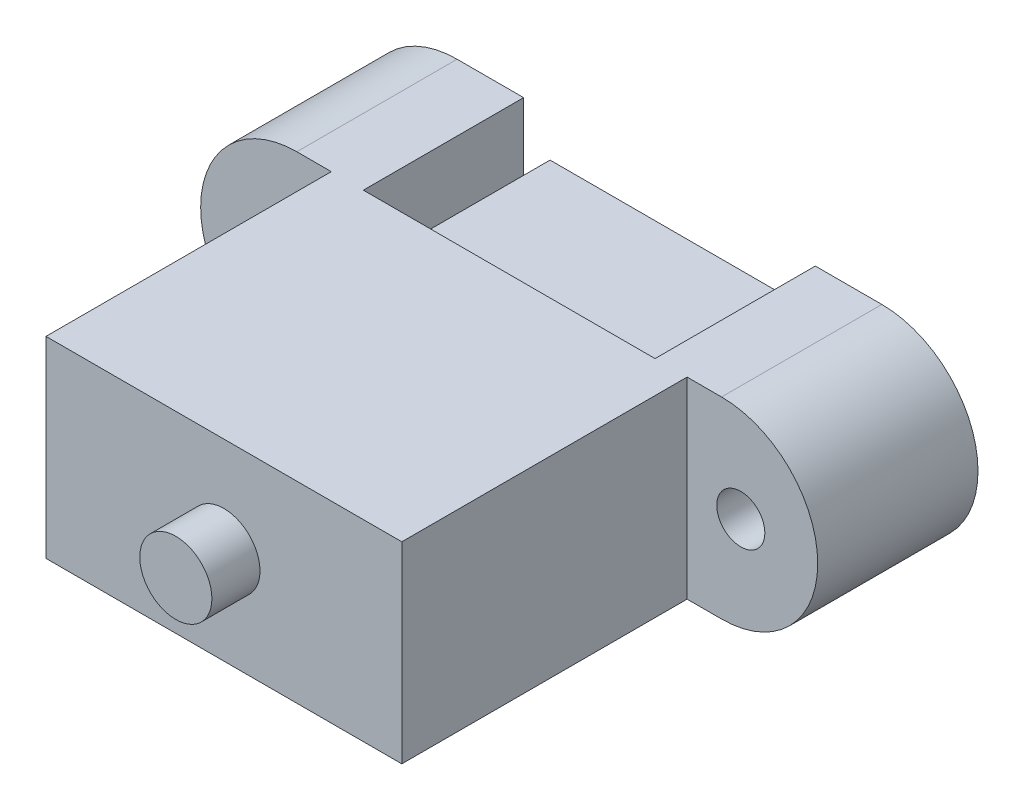
ISO-10303-21;
HEADER;
FILE_DESCRIPTION(('STEP AP214'),'2;1');
FILE_NAME('part.step','',(''),(''),'','','');
FILE_SCHEMA(('AUTOMOTIVE_DESIGN { 1 0 10303 214 1 1 1 1 }'));
ENDSEC;
DATA;
#1=APPLICATION_CONTEXT('core data for automotive mechanical design processes');
#2=APPLICATION_PROTOCOL_DEFINITION('international standard','automotive_design',2000,#1);
#3=PRODUCT_CONTEXT('',#1,'mechanical');
#4=PRODUCT('Part','Part','',(#3));
#5=PRODUCT_RELATED_PRODUCT_CATEGORY('part','',(#4));
#6=PRODUCT_DEFINITION_FORMATION('','',#4);
#7=PRODUCT_DEFINITION_CONTEXT('part definition',#1,'design');
#8=PRODUCT_DEFINITION('design','',#6,#7);
#9=PRODUCT_DEFINITION_SHAPE('','',#8);
#10=(LENGTH_UNIT() NAMED_UNIT(*) SI_UNIT(.MILLI.,.METRE.));
#11=(NAMED_UNIT(*) PLANE_ANGLE_UNIT() SI_UNIT($,.RADIAN.));
#12=(NAMED_UNIT(*) SI_UNIT($,.STERADIAN.) SOLID_ANGLE_UNIT());
#13=UNCERTAINTY_MEASURE_WITH_UNIT(LENGTH_MEASURE(1.E-05),#10,'distance_accuracy_value','');
#14=(GEOMETRIC_REPRESENTATION_CONTEXT(3) GLOBAL_UNCERTAINTY_ASSIGNED_CONTEXT((#13)) GLOBAL_UNIT_ASSIGNED_CONTEXT((#10,
#11,#12)) REPRESENTATION_CONTEXT('',''));
#15=CARTESIAN_POINT('',(0.,0.,0.));
#16=DIRECTION('',(0.,0.,1.));
#17=DIRECTION('',(1.,0.,0.));
#18=AXIS2_PLACEMENT_3D('',#15,#16,#17);
#19=CARTESIAN_POINT('',(-11.1,6.,10.));
#20=DIRECTION('',(0.,0.,1.));
#21=DIRECTION('',(1.,0.,0.));
#22=AXIS2_PLACEMENT_3D('',#19,#20,#21);
#23=PLANE('',#22);
#24=DIRECTION('',(0.,-1.,0.));
#25=VECTOR('',#24,1.);
#26=CARTESIAN_POINT('',(9.1,6.,10.));
#27=LINE('',#26,#25);
#28=CARTESIAN_POINT('',(9.1,6.,10.));
#29=VERTEX_POINT('',#28);
#30=CARTESIAN_POINT('',(9.1,-6.,10.));
#31=VERTEX_POINT('',#30);
#32=EDGE_CURVE('E322',#29,#31,#27,.T.);
#33=ORIENTED_EDGE('',*,*,#32,.T.);
#34=DIRECTION('',(1.,0.,0.));
#35=VECTOR('',#34,1.);
#36=CARTESIAN_POINT('',(11.1,-6.,10.));
#37=LINE('',#36,#35);
#38=CARTESIAN_POINT('',(-9.1,-6.,10.));
#39=VERTEX_POINT('',#38);
#40=EDGE_CURVE('E365',#39,#31,#37,.T.);
#41=ORIENTED_EDGE('',*,*,#40,.F.);
#42=DIRECTION('',(0.,1.,0.));
#43=VECTOR('',#42,1.);
#44=CARTESIAN_POINT('',(-9.1,6.,10.));
#45=LINE('',#44,#43);
#46=CARTESIAN_POINT('',(-9.1,6.,10.));
#47=VERTEX_POINT('',#46);
#48=EDGE_CURVE('E373',#39,#47,#45,.T.);
#49=ORIENTED_EDGE('',*,*,#48,.T.);
#50=DIRECTION('',(-1.,0.,0.));
#51=VECTOR('',#50,1.);
#52=CARTESIAN_POINT('',(11.1,6.,10.));
#53=LINE('',#52,#51);
#54=EDGE_CURVE('E36',#29,#47,#53,.T.);
#55=ORIENTED_EDGE('',*,*,#54,.F.);
#56=EDGE_LOOP('',(#33,#41,#49,#55));
#57=FACE_BOUND('',#56,.T.);
#58=DIRECTION('',(0.,-1.,0.));
#59=VECTOR('',#58,1.);
#60=CARTESIAN_POINT('',(7.45,3.45,10.));
#61=LINE('',#60,#59);
#62=CARTESIAN_POINT('',(7.45,3.45,10.));
#63=VERTEX_POINT('',#62);
#64=CARTESIAN_POINT('',(7.45,-3.45,10.));
#65=VERTEX_POINT('',#64);
#66=EDGE_CURVE('E281',#63,#65,#61,.T.);
#67=ORIENTED_EDGE('',*,*,#66,.F.);
#68=DIRECTION('',(1.,0.,0.));
#69=VECTOR('',#68,1.);
#70=CARTESIAN_POINT('',(-7.45,3.45,10.));
#71=LINE('',#70,#69);
#72=CARTESIAN_POINT('',(-7.45,3.45,10.));
#73=VERTEX_POINT('',#72);
#74=EDGE_CURVE('E268',#73,#63,#71,.T.);
#75=ORIENTED_EDGE('',*,*,#74,.F.);
#76=DIRECTION('',(0.,1.,0.));
#77=VECTOR('',#76,1.);
#78=CARTESIAN_POINT('',(-7.45,3.45,10.));
#79=LINE('',#78,#77);
#80=CARTESIAN_POINT('',(-7.45,-3.45,10.));
#81=VERTEX_POINT('',#80);
#82=EDGE_CURVE('E273',#81,#73,#79,.T.);
#83=ORIENTED_EDGE('',*,*,#82,.F.);
#84=DIRECTION('',(-1.,0.,0.));
#85=VECTOR('',#84,1.);
#86=CARTESIAN_POINT('',(-7.45,-3.45,10.));
#87=LINE('',#86,#85);
#88=EDGE_CURVE('E277',#65,#81,#87,.T.);
#89=ORIENTED_EDGE('',*,*,#88,.F.);
#90=EDGE_LOOP('',(#67,#75,#83,#89));
#91=FACE_BOUND('',#90,.T.);
#92=ADVANCED_FACE('F32',(#57,#91),#23,.F.);
#93=CARTESIAN_POINT('',(-11.1,6.,27.8));
#94=DIRECTION('',(0.,0.,1.));
#95=DIRECTION('',(1.,0.,0.));
#96=AXIS2_PLACEMENT_3D('',#93,#94,#95);
#97=PLANE('',#96);
#98=DIRECTION('',(0.,-1.,0.));
#99=VECTOR('',#98,1.);
#100=CARTESIAN_POINT('',(-11.1,-6.,27.8));
#101=LINE('',#100,#99);
#102=CARTESIAN_POINT('',(-11.1,6.,27.8));
#103=VERTEX_POINT('',#102);
#104=CARTESIAN_POINT('',(-11.1,-6.,27.8));
#105=VERTEX_POINT('',#104);
#106=EDGE_CURVE('E347',#103,#105,#101,.T.);
#107=ORIENTED_EDGE('',*,*,#106,.T.);
#108=DIRECTION('',(1.,0.,0.));
#109=VECTOR('',#108,1.);
#110=CARTESIAN_POINT('',(11.1,-6.,27.8));
#111=LINE('',#110,#109);
#112=CARTESIAN_POINT('',(11.1,-6.,27.8));
#113=VERTEX_POINT('',#112);
#114=EDGE_CURVE('E350',#105,#113,#111,.T.);
#115=ORIENTED_EDGE('',*,*,#114,.T.);
#116=DIRECTION('',(0.,1.,0.));
#117=VECTOR('',#116,1.);
#118=CARTESIAN_POINT('',(11.1,-6.,27.8));
#119=LINE('',#118,#117);
#120=CARTESIAN_POINT('',(11.1,6.,27.8));
#121=VERTEX_POINT('',#120);
#122=EDGE_CURVE('E352',#113,#121,#119,.T.);
#123=ORIENTED_EDGE('',*,*,#122,.T.);
#124=DIRECTION('',(-1.,0.,0.));
#125=VECTOR('',#124,1.);
#126=CARTESIAN_POINT('',(11.1,6.,27.8));
#127=LINE('',#126,#125);
#128=EDGE_CURVE('E354',#121,#103,#127,.T.);
#129=ORIENTED_EDGE('',*,*,#128,.T.);
#130=EDGE_LOOP('',(#107,#115,#123,#129));
#131=FACE_BOUND('',#130,.T.);
#132=CARTESIAN_POINT('',(0.,0.,27.8));
#133=DIRECTION('',(0.,0.,1.));
#134=DIRECTION('',(1.,0.,0.));
#135=AXIS2_PLACEMENT_3D('',#132,#133,#134);
#136=CIRCLE('',#135,2.25);
#137=CARTESIAN_POINT('',(2.25,0.,27.8));
#138=VERTEX_POINT('',#137);
#139=EDGE_CURVE('E287',#138,#138,#136,.T.);
#140=ORIENTED_EDGE('',*,*,#139,.F.);
#141=EDGE_LOOP('',(#140));
#142=FACE_BOUND('',#141,.T.);
#143=ADVANCED_FACE('F456',(#131,#142),#97,.T.);
#144=CARTESIAN_POINT('',(-13.25,0.,10.));
#145=DIRECTION('',(0.,0.,-1.));
#146=DIRECTION('',(-1.,0.,0.));
#147=AXIS2_PLACEMENT_3D('',#144,#145,#146);
#148=PLANE('',#147);
#149=CARTESIAN_POINT('',(-14.45,0.,10.));
#150=DIRECTION('',(0.,0.,1.));
#151=DIRECTION('',(1.,0.,0.));
#152=AXIS2_PLACEMENT_3D('',#149,#150,#151);
#153=CIRCLE('',#152,1.5);
#154=CARTESIAN_POINT('',(-12.95,0.,10.));
#155=VERTEX_POINT('',#154);
#156=EDGE_CURVE('E400',#155,#155,#153,.T.);
#157=ORIENTED_EDGE('',*,*,#156,.F.);
#158=EDGE_LOOP('',(#157));
#159=FACE_BOUND('',#158,.T.);
#160=DIRECTION('',(0.,-1.,0.));
#161=VECTOR('',#160,1.);
#162=CARTESIAN_POINT('',(-11.1,-6.,10.));
#163=LINE('',#162,#161);
#164=CARTESIAN_POINT('',(-11.1,6.,10.));
#165=VERTEX_POINT('',#164);
#166=CARTESIAN_POINT('',(-11.1,-6.,10.));
#167=VERTEX_POINT('',#166);
#168=EDGE_CURVE('E346',#165,#167,#163,.T.);
#169=ORIENTED_EDGE('',*,*,#168,.F.);
#170=DIRECTION('',(-1.,0.,0.));
#171=VECTOR('',#170,1.);
#172=CARTESIAN_POINT('',(-13.25,5.99999999999999,10.));
#173=LINE('',#172,#171);
#174=CARTESIAN_POINT('',(-13.25,5.99999999999999,10.));
#175=VERTEX_POINT('',#174);
#176=EDGE_CURVE('E377',#165,#175,#173,.T.);
#177=ORIENTED_EDGE('',*,*,#176,.T.);
#178=CARTESIAN_POINT('',(-13.25,0.,10.));
#179=DIRECTION('',(0.,0.,1.));
#180=DIRECTION('',(-1.,0.,0.));
#181=AXIS2_PLACEMENT_3D('',#178,#179,#180);
#182=CIRCLE('',#181,5.99999999999999);
#183=CARTESIAN_POINT('',(-13.25,-5.99999999999999,10.));
#184=VERTEX_POINT('',#183);
#185=EDGE_CURVE('E415',#175,#184,#182,.T.);
#186=ORIENTED_EDGE('',*,*,#185,.T.);
#187=DIRECTION('',(1.,0.,0.));
#188=VECTOR('',#187,1.);
#189=CARTESIAN_POINT('',(-13.25,-5.99999999999999,10.));
#190=LINE('',#189,#188);
#191=EDGE_CURVE('E378',#184,#167,#190,.T.);
#192=ORIENTED_EDGE('',*,*,#191,.T.);
#193=EDGE_LOOP('',(#169,#177,#186,#192));
#194=FACE_BOUND('',#193,.T.);
#195=ADVANCED_FACE('F453',(#159,#194),#148,.F.);
#196=CARTESIAN_POINT('',(-13.25,0.,0.));
#197=DIRECTION('',(0.,0.,-1.));
#198=DIRECTION('',(-1.,0.,0.));
#199=AXIS2_PLACEMENT_3D('',#196,#197,#198);
#200=PLANE('',#199);
#201=CARTESIAN_POINT('',(-13.25,0.,0.));
#202=DIRECTION('',(0.,0.,1.));
#203=DIRECTION('',(-1.,0.,0.));
#204=AXIS2_PLACEMENT_3D('',#201,#202,#203);
#205=CIRCLE('',#204,5.99999999999999);
#206=CARTESIAN_POINT('',(-13.25,5.99999999999999,0.));
#207=VERTEX_POINT('',#206);
#208=CARTESIAN_POINT('',(-13.25,-5.99999999999999,0.));
#209=VERTEX_POINT('',#208);
#210=EDGE_CURVE('E388',#207,#209,#205,.T.);
#211=ORIENTED_EDGE('',*,*,#210,.F.);
#212=DIRECTION('',(-1.,0.,0.));
#213=VECTOR('',#212,1.);
#214=CARTESIAN_POINT('',(-13.25,5.99999999999999,0.));
#215=LINE('',#214,#213);
#216=CARTESIAN_POINT('',(-9.1,6.,0.));
#217=VERTEX_POINT('',#216);
#218=EDGE_CURVE('E417',#217,#207,#215,.T.);
#219=ORIENTED_EDGE('',*,*,#218,.F.);
#220=DIRECTION('',(0.,1.,0.));
#221=VECTOR('',#220,1.);
#222=CARTESIAN_POINT('',(-9.1,6.,0.));
#223=LINE('',#222,#221);
#224=CARTESIAN_POINT('',(-9.1,-6.,0.));
#225=VERTEX_POINT('',#224);
#226=EDGE_CURVE('E421',#225,#217,#223,.T.);
#227=ORIENTED_EDGE('',*,*,#226,.F.);
#228=DIRECTION('',(1.,0.,0.));
#229=VECTOR('',#228,1.);
#230=CARTESIAN_POINT('',(-13.25,-5.99999999999999,0.));
#231=LINE('',#230,#229);
#232=EDGE_CURVE('E428',#209,#225,#231,.T.);
#233=ORIENTED_EDGE('',*,*,#232,.F.);
#234=EDGE_LOOP('',(#211,#219,#227,#233));
#235=FACE_BOUND('',#234,.T.);
#236=CARTESIAN_POINT('',(-14.45,0.,0.));
#237=DIRECTION('',(0.,0.,1.));
#238=DIRECTION('',(1.,0.,0.));
#239=AXIS2_PLACEMENT_3D('',#236,#237,#238);
#240=CIRCLE('',#239,1.5);
#241=CARTESIAN_POINT('',(-12.95,0.,0.));
#242=VERTEX_POINT('',#241);
#243=EDGE_CURVE('E395',#242,#242,#240,.T.);
#244=ORIENTED_EDGE('',*,*,#243,.T.);
#245=EDGE_LOOP('',(#244));
#246=FACE_BOUND('',#245,.T.);
#247=ADVANCED_FACE('F445',(#235,#246),#200,.T.);
#248=CARTESIAN_POINT('',(-13.25,0.,10.));
#249=DIRECTION('',(0.,0.,-1.));
#250=DIRECTION('',(-1.,0.,0.));
#251=AXIS2_PLACEMENT_3D('',#248,#249,#250);
#252=CYLINDRICAL_SURFACE('',#251,5.99999999999999);
#253=ORIENTED_EDGE('',*,*,#210,.T.);
#254=DIRECTION('',(0.,0.,-1.));
#255=VECTOR('',#254,1.);
#256=CARTESIAN_POINT('',(-13.25,-5.99999999999999,10.));
#257=LINE('',#256,#255);
#258=EDGE_CURVE('E11',#184,#209,#257,.T.);
#259=ORIENTED_EDGE('',*,*,#258,.F.);
#260=ORIENTED_EDGE('',*,*,#185,.F.);
#261=DIRECTION('',(0.,0.,-1.));
#262=VECTOR('',#261,1.);
#263=CARTESIAN_POINT('',(-13.25,5.99999999999999,10.));
#264=LINE('',#263,#262);
#265=EDGE_CURVE('E392',#175,#207,#264,.T.);
#266=ORIENTED_EDGE('',*,*,#265,.T.);
#267=EDGE_LOOP('',(#253,#259,#260,#266));
#268=FACE_BOUND('',#267,.T.);
#269=ADVANCED_FACE('F34',(#268),#252,.T.);
#270=CARTESIAN_POINT('',(-13.25,-5.99999999999999,10.));
#271=DIRECTION('',(0.,1.,0.));
#272=DIRECTION('',(-1.,0.,0.));
#273=AXIS2_PLACEMENT_3D('',#270,#271,#272);
#274=PLANE('',#273);
#275=ORIENTED_EDGE('',*,*,#232,.T.);
#276=DIRECTION('',(0.,0.,-1.));
#277=VECTOR('',#276,1.);
#278=CARTESIAN_POINT('',(-9.1,-6.,10.));
#279=LINE('',#278,#277);
#280=EDGE_CURVE('E42',#39,#225,#279,.T.);
#281=ORIENTED_EDGE('',*,*,#280,.F.);
#282=ORIENTED_EDGE('',*,*,#40,.T.);
#283=DIRECTION('',(0.,0.,-1.));
#284=VECTOR('',#283,1.);
#285=CARTESIAN_POINT('',(9.1,-6.,10.));
#286=LINE('',#285,#284);
#287=CARTESIAN_POINT('',(9.1,-6.,0.));
#288=VERTEX_POINT('',#287);
#289=EDGE_CURVE('E337',#31,#288,#286,.T.);
#290=ORIENTED_EDGE('',*,*,#289,.T.);
#291=DIRECTION('',(1.,0.,0.));
#292=VECTOR('',#291,1.);
#293=CARTESIAN_POINT('',(9.1,-6.,0.));
#294=LINE('',#293,#292);
#295=CARTESIAN_POINT('',(13.25,-5.99999999999999,0.));
#296=VERTEX_POINT('',#295);
#297=EDGE_CURVE('E320',#288,#296,#294,.T.);
#298=ORIENTED_EDGE('',*,*,#297,.T.);
#299=DIRECTION('',(0.,0.,-1.));
#300=VECTOR('',#299,1.);
#301=CARTESIAN_POINT('',(13.25,-5.99999999999999,10.));
#302=LINE('',#301,#300);
#303=CARTESIAN_POINT('',(13.25,-5.99999999999999,10.));
#304=VERTEX_POINT('',#303);
#305=EDGE_CURVE('E327',#304,#296,#302,.T.);
#306=ORIENTED_EDGE('',*,*,#305,.F.);
#307=DIRECTION('',(1.,0.,0.));
#308=VECTOR('',#307,1.);
#309=CARTESIAN_POINT('',(9.1,-6.,10.));
#310=LINE('',#309,#308);
#311=CARTESIAN_POINT('',(11.1,-6.,10.));
#312=VERTEX_POINT('',#311);
#313=EDGE_CURVE('E325',#312,#304,#310,.T.);
#314=ORIENTED_EDGE('',*,*,#313,.F.);
#315=DIRECTION('',(0.,0.,-1.));
#316=VECTOR('',#315,1.);
#317=CARTESIAN_POINT('',(11.1,-6.,27.8));
#318=LINE('',#317,#316);
#319=EDGE_CURVE('E396',#113,#312,#318,.T.);
#320=ORIENTED_EDGE('',*,*,#319,.F.);
#321=ORIENTED_EDGE('',*,*,#114,.F.);
#322=DIRECTION('',(0.,0.,-1.));
#323=VECTOR('',#322,1.);
#324=CARTESIAN_POINT('',(-11.1,-6.,27.8));
#325=LINE('',#324,#323);
#326=EDGE_CURVE('E393',#105,#167,#325,.T.);
#327=ORIENTED_EDGE('',*,*,#326,.T.);
#328=ORIENTED_EDGE('',*,*,#191,.F.);
#329=ORIENTED_EDGE('',*,*,#258,.T.);
#330=EDGE_LOOP('',(#275,#281,#282,#290,#298,#306,#314,#320,#321,#327,#328,#329));
#331=FACE_BOUND('',#330,.T.);
#332=ADVANCED_FACE('F447',(#331),#274,.F.);
#333=CARTESIAN_POINT('',(-9.1,6.,10.));
#334=DIRECTION('',(-1.,0.,0.));
#335=DIRECTION('',(0.,0.,1.));
#336=AXIS2_PLACEMENT_3D('',#333,#334,#335);
#337=PLANE('',#336);
#338=ORIENTED_EDGE('',*,*,#226,.T.);
#339=DIRECTION('',(0.,0.,-1.));
#340=VECTOR('',#339,1.);
#341=CARTESIAN_POINT('',(-9.1,6.,10.));
#342=LINE('',#341,#340);
#343=EDGE_CURVE('E379',#47,#217,#342,.T.);
#344=ORIENTED_EDGE('',*,*,#343,.F.);
#345=ORIENTED_EDGE('',*,*,#48,.F.);
#346=ORIENTED_EDGE('',*,*,#280,.T.);
#347=EDGE_LOOP('',(#338,#344,#345,#346));
#348=FACE_BOUND('',#347,.T.);
#349=ADVANCED_FACE('F442',(#348),#337,.F.);
#350=CARTESIAN_POINT('',(-13.25,5.99999999999999,10.));
#351=DIRECTION('',(0.,-1.,0.));
#352=DIRECTION('',(1.,0.,0.));
#353=AXIS2_PLACEMENT_3D('',#350,#351,#352);
#354=PLANE('',#353);
#355=ORIENTED_EDGE('',*,*,#218,.T.);
#356=ORIENTED_EDGE('',*,*,#265,.F.);
#357=ORIENTED_EDGE('',*,*,#176,.F.);
#358=DIRECTION('',(0.,0.,-1.));
#359=VECTOR('',#358,1.);
#360=CARTESIAN_POINT('',(-11.1,6.,27.8));
#361=LINE('',#360,#359);
#362=EDGE_CURVE('E356',#103,#165,#361,.T.);
#363=ORIENTED_EDGE('',*,*,#362,.F.);
#364=ORIENTED_EDGE('',*,*,#128,.F.);
#365=DIRECTION('',(0.,0.,-1.));
#366=VECTOR('',#365,1.);
#367=CARTESIAN_POINT('',(11.1,6.,27.8));
#368=LINE('',#367,#366);
#369=CARTESIAN_POINT('',(11.1,6.,10.));
#370=VERTEX_POINT('',#369);
#371=EDGE_CURVE('E370',#121,#370,#368,.T.);
#372=ORIENTED_EDGE('',*,*,#371,.T.);
#373=DIRECTION('',(-1.,0.,0.));
#374=VECTOR('',#373,1.);
#375=CARTESIAN_POINT('',(9.1,6.,10.));
#376=LINE('',#375,#374);
#377=CARTESIAN_POINT('',(13.25,5.99999999999999,10.));
#378=VERTEX_POINT('',#377);
#379=EDGE_CURVE('E319',#378,#370,#376,.T.);
#380=ORIENTED_EDGE('',*,*,#379,.F.);
#381=DIRECTION('',(0.,0.,-1.));
#382=VECTOR('',#381,1.);
#383=CARTESIAN_POINT('',(13.25,5.99999999999999,10.));
#384=LINE('',#383,#382);
#385=CARTESIAN_POINT('',(13.25,5.99999999999999,0.));
#386=VERTEX_POINT('',#385);
#387=EDGE_CURVE('E343',#378,#386,#384,.T.);
#388=ORIENTED_EDGE('',*,*,#387,.T.);
#389=DIRECTION('',(-1.,0.,0.));
#390=VECTOR('',#389,1.);
#391=CARTESIAN_POINT('',(9.1,6.,0.));
#392=LINE('',#391,#390);
#393=CARTESIAN_POINT('',(9.1,6.,0.));
#394=VERTEX_POINT('',#393);
#395=EDGE_CURVE('E330',#386,#394,#392,.T.);
#396=ORIENTED_EDGE('',*,*,#395,.T.);
#397=DIRECTION('',(0.,0.,-1.));
#398=VECTOR('',#397,1.);
#399=CARTESIAN_POINT('',(9.1,6.,10.));
#400=LINE('',#399,#398);
#401=EDGE_CURVE('E340',#29,#394,#400,.T.);
#402=ORIENTED_EDGE('',*,*,#401,.F.);
#403=ORIENTED_EDGE('',*,*,#54,.T.);
#404=ORIENTED_EDGE('',*,*,#343,.T.);
#405=EDGE_LOOP('',(#355,#356,#357,#363,#364,#372,#380,#388,#396,#402,#403,#404));
#406=FACE_BOUND('',#405,.T.);
#407=ADVANCED_FACE('F478',(#406),#354,.F.);
#408=CARTESIAN_POINT('',(-14.45,0.,10.));
#409=DIRECTION('',(0.,0.,-1.));
#410=DIRECTION('',(-1.,0.,0.));
#411=AXIS2_PLACEMENT_3D('',#408,#409,#410);
#412=CYLINDRICAL_SURFACE('',#411,1.5);
#413=ORIENTED_EDGE('',*,*,#156,.T.);
#414=EDGE_LOOP('',(#413));
#415=FACE_BOUND('',#414,.T.);
#416=ORIENTED_EDGE('',*,*,#243,.F.);
#417=EDGE_LOOP('',(#416));
#418=FACE_BOUND('',#417,.T.);
#419=ADVANCED_FACE('F474',(#415,#418),#412,.F.);
#420=CARTESIAN_POINT('',(-11.1,-6.,27.8));
#421=DIRECTION('',(1.,0.,0.));
#422=DIRECTION('',(0.,0.,-1.));
#423=AXIS2_PLACEMENT_3D('',#420,#421,#422);
#424=PLANE('',#423);
#425=ORIENTED_EDGE('',*,*,#168,.T.);
#426=ORIENTED_EDGE('',*,*,#326,.F.);
#427=ORIENTED_EDGE('',*,*,#106,.F.);
#428=ORIENTED_EDGE('',*,*,#362,.T.);
#429=EDGE_LOOP('',(#425,#426,#427,#428));
#430=FACE_BOUND('',#429,.T.);
#431=ADVANCED_FACE('F471',(#430),#424,.F.);
#432=CARTESIAN_POINT('',(11.1,-6.,27.8));
#433=DIRECTION('',(-1.,0.,0.));
#434=DIRECTION('',(0.,0.,1.));
#435=AXIS2_PLACEMENT_3D('',#432,#433,#434);
#436=PLANE('',#435);
#437=DIRECTION('',(0.,1.,0.));
#438=VECTOR('',#437,1.);
#439=CARTESIAN_POINT('',(11.1,-6.,10.));
#440=LINE('',#439,#438);
#441=EDGE_CURVE('E413',#312,#370,#440,.T.);
#442=ORIENTED_EDGE('',*,*,#441,.T.);
#443=ORIENTED_EDGE('',*,*,#371,.F.);
#444=ORIENTED_EDGE('',*,*,#122,.F.);
#445=ORIENTED_EDGE('',*,*,#319,.T.);
#446=EDGE_LOOP('',(#442,#443,#444,#445));
#447=FACE_BOUND('',#446,.T.);
#448=ADVANCED_FACE('F467',(#447),#436,.F.);
#449=CARTESIAN_POINT('',(13.25,0.,10.));
#450=DIRECTION('',(0.,0.,-1.));
#451=DIRECTION('',(-1.,0.,0.));
#452=AXIS2_PLACEMENT_3D('',#449,#450,#451);
#453=PLANE('',#452);
#454=CARTESIAN_POINT('',(14.45,0.,10.));
#455=DIRECTION('',(0.,0.,1.));
#456=DIRECTION('',(1.,0.,0.));
#457=AXIS2_PLACEMENT_3D('',#454,#455,#456);
#458=CIRCLE('',#457,1.5);
#459=CARTESIAN_POINT('',(15.95,0.,10.));
#460=VERTEX_POINT('',#459);
#461=EDGE_CURVE('E310',#460,#460,#458,.T.);
#462=ORIENTED_EDGE('',*,*,#461,.F.);
#463=EDGE_LOOP('',(#462));
#464=FACE_BOUND('',#463,.T.);
#465=ORIENTED_EDGE('',*,*,#379,.T.);
#466=ORIENTED_EDGE('',*,*,#441,.F.);
#467=ORIENTED_EDGE('',*,*,#313,.T.);
#468=CARTESIAN_POINT('',(13.25,0.,10.));
#469=DIRECTION('',(0.,0.,1.));
#470=DIRECTION('',(-1.,0.,0.));
#471=AXIS2_PLACEMENT_3D('',#468,#469,#470);
#472=CIRCLE('',#471,5.99999999999999);
#473=EDGE_CURVE('E316',#304,#378,#472,.T.);
#474=ORIENTED_EDGE('',*,*,#473,.T.);
#475=EDGE_LOOP('',(#465,#466,#467,#474));
#476=FACE_BOUND('',#475,.T.);
#477=ADVANCED_FACE('F470',(#464,#476),#453,.F.);
#478=CARTESIAN_POINT('',(13.25,0.,0.));
#479=DIRECTION('',(0.,0.,-1.));
#480=DIRECTION('',(-1.,0.,0.));
#481=AXIS2_PLACEMENT_3D('',#478,#479,#480);
#482=PLANE('',#481);
#483=CARTESIAN_POINT('',(13.25,0.,0.));
#484=DIRECTION('',(0.,0.,1.));
#485=DIRECTION('',(-1.,0.,0.));
#486=AXIS2_PLACEMENT_3D('',#483,#484,#485);
#487=CIRCLE('',#486,5.99999999999999);
#488=EDGE_CURVE('E313',#296,#386,#487,.T.);
#489=ORIENTED_EDGE('',*,*,#488,.F.);
#490=ORIENTED_EDGE('',*,*,#297,.F.);
#491=DIRECTION('',(0.,-1.,0.));
#492=VECTOR('',#491,1.);
#493=CARTESIAN_POINT('',(9.1,6.,0.));
#494=LINE('',#493,#492);
#495=EDGE_CURVE('E332',#394,#288,#494,.T.);
#496=ORIENTED_EDGE('',*,*,#495,.F.);
#497=ORIENTED_EDGE('',*,*,#395,.F.);
#498=EDGE_LOOP('',(#489,#490,#496,#497));
#499=FACE_BOUND('',#498,.T.);
#500=CARTESIAN_POINT('',(14.45,0.,0.));
#501=DIRECTION('',(0.,0.,1.));
#502=DIRECTION('',(1.,0.,0.));
#503=AXIS2_PLACEMENT_3D('',#500,#501,#502);
#504=CIRCLE('',#503,1.5);
#505=CARTESIAN_POINT('',(15.95,0.,0.));
#506=VERTEX_POINT('',#505);
#507=EDGE_CURVE('E307',#506,#506,#504,.T.);
#508=ORIENTED_EDGE('',*,*,#507,.T.);
#509=EDGE_LOOP('',(#508));
#510=FACE_BOUND('',#509,.T.);
#511=ADVANCED_FACE('F513',(#499,#510),#482,.T.);
#512=CARTESIAN_POINT('',(13.25,0.,10.));
#513=DIRECTION('',(0.,0.,-1.));
#514=DIRECTION('',(-1.,0.,0.));
#515=AXIS2_PLACEMENT_3D('',#512,#513,#514);
#516=CYLINDRICAL_SURFACE('',#515,5.99999999999999);
#517=ORIENTED_EDGE('',*,*,#488,.T.);
#518=ORIENTED_EDGE('',*,*,#387,.F.);
#519=ORIENTED_EDGE('',*,*,#473,.F.);
#520=ORIENTED_EDGE('',*,*,#305,.T.);
#521=EDGE_LOOP('',(#517,#518,#519,#520));
#522=FACE_BOUND('',#521,.T.);
#523=ADVANCED_FACE('F521',(#522),#516,.T.);
#524=CARTESIAN_POINT('',(9.1,6.,10.));
#525=DIRECTION('',(1.,0.,0.));
#526=DIRECTION('',(0.,0.,-1.));
#527=AXIS2_PLACEMENT_3D('',#524,#525,#526);
#528=PLANE('',#527);
#529=ORIENTED_EDGE('',*,*,#495,.T.);
#530=ORIENTED_EDGE('',*,*,#289,.F.);
#531=ORIENTED_EDGE('',*,*,#32,.F.);
#532=ORIENTED_EDGE('',*,*,#401,.T.);
#533=EDGE_LOOP('',(#529,#530,#531,#532));
#534=FACE_BOUND('',#533,.T.);
#535=ADVANCED_FACE('F529',(#534),#528,.F.);
#536=CARTESIAN_POINT('',(14.45,0.,10.));
#537=DIRECTION('',(0.,0.,-1.));
#538=DIRECTION('',(-1.,0.,0.));
#539=AXIS2_PLACEMENT_3D('',#536,#537,#538);
#540=CYLINDRICAL_SURFACE('',#539,1.5);
#541=ORIENTED_EDGE('',*,*,#461,.T.);
#542=EDGE_LOOP('',(#541));
#543=FACE_BOUND('',#542,.T.);
#544=ORIENTED_EDGE('',*,*,#507,.F.);
#545=EDGE_LOOP('',(#544));
#546=FACE_BOUND('',#545,.T.);
#547=ADVANCED_FACE('F536',(#543,#546),#540,.F.);
#548=CARTESIAN_POINT('',(0.,0.,30.8));
#549=DIRECTION('',(0.,0.,-1.));
#550=DIRECTION('',(-1.,0.,0.));
#551=AXIS2_PLACEMENT_3D('',#548,#549,#550);
#552=CYLINDRICAL_SURFACE('',#551,2.25);
#553=CARTESIAN_POINT('',(0.,0.,30.8));
#554=DIRECTION('',(0.,0.,1.));
#555=DIRECTION('',(1.,0.,0.));
#556=AXIS2_PLACEMENT_3D('',#553,#554,#555);
#557=CIRCLE('',#556,2.25);
#558=CARTESIAN_POINT('',(2.25,0.,30.8));
#559=VERTEX_POINT('',#558);
#560=EDGE_CURVE('E304',#559,#559,#557,.T.);
#561=ORIENTED_EDGE('',*,*,#560,.F.);
#562=EDGE_LOOP('',(#561));
#563=FACE_BOUND('',#562,.T.);
#564=ORIENTED_EDGE('',*,*,#139,.T.);
#565=EDGE_LOOP('',(#564));
#566=FACE_BOUND('',#565,.T.);
#567=ADVANCED_FACE('F544',(#563,#566),#552,.T.);
#568=CARTESIAN_POINT('',(0.,0.,30.8));
#569=DIRECTION('',(0.,0.,1.));
#570=DIRECTION('',(1.,0.,0.));
#571=AXIS2_PLACEMENT_3D('',#568,#569,#570);
#572=PLANE('',#571);
#573=ORIENTED_EDGE('',*,*,#560,.T.);
#574=EDGE_LOOP('',(#573));
#575=FACE_BOUND('',#574,.T.);
#576=ADVANCED_FACE('F553',(#575),#572,.T.);
#577=CARTESIAN_POINT('',(7.45,3.45,-16.4201096220458));
#578=DIRECTION('',(-1.,0.,0.));
#579=DIRECTION('',(0.,-1.,0.));
#580=AXIS2_PLACEMENT_3D('',#577,#578,#579);
#581=PLANE('',#580);
#582=DIRECTION('',(0.,-1.,0.));
#583=VECTOR('',#582,1.);
#584=CARTESIAN_POINT('',(7.45,3.45,0.));
#585=LINE('',#584,#583);
#586=CARTESIAN_POINT('',(7.45,3.45,0.));
#587=VERTEX_POINT('',#586);
#588=CARTESIAN_POINT('',(7.45,-3.45,0.));
#589=VERTEX_POINT('',#588);
#590=EDGE_CURVE('E291',#587,#589,#585,.T.);
#591=ORIENTED_EDGE('',*,*,#590,.F.);
#592=DIRECTION('',(0.,0.,1.));
#593=VECTOR('',#592,1.);
#594=CARTESIAN_POINT('',(7.45,3.45,-16.4201096220458));
#595=LINE('',#594,#593);
#596=EDGE_CURVE('E262',#587,#63,#595,.T.);
#597=ORIENTED_EDGE('',*,*,#596,.T.);
#598=ORIENTED_EDGE('',*,*,#66,.T.);
#599=DIRECTION('',(0.,0.,1.));
#600=VECTOR('',#599,1.);
#601=CARTESIAN_POINT('',(7.45,-3.45,-16.4201096220458));
#602=LINE('',#601,#600);
#603=EDGE_CURVE('E280',#589,#65,#602,.T.);
#604=ORIENTED_EDGE('',*,*,#603,.F.);
#605=EDGE_LOOP('',(#591,#597,#598,#604));
#606=FACE_BOUND('',#605,.T.);
#607=ADVANCED_FACE('F561',(#606),#581,.F.);
#608=CARTESIAN_POINT('',(-7.45,-3.45,-16.4201096220458));
#609=DIRECTION('',(0.,1.,0.));
#610=DIRECTION('',(-1.,0.,0.));
#611=AXIS2_PLACEMENT_3D('',#608,#609,#610);
#612=PLANE('',#611);
#613=DIRECTION('',(-1.,0.,0.));
#614=VECTOR('',#613,1.);
#615=CARTESIAN_POINT('',(-7.45,-3.45,0.));
#616=LINE('',#615,#614);
#617=CARTESIAN_POINT('',(-7.45,-3.45,0.));
#618=VERTEX_POINT('',#617);
#619=EDGE_CURVE('E288',#589,#618,#616,.T.);
#620=ORIENTED_EDGE('',*,*,#619,.F.);
#621=ORIENTED_EDGE('',*,*,#603,.T.);
#622=ORIENTED_EDGE('',*,*,#88,.T.);
#623=DIRECTION('',(0.,0.,1.));
#624=VECTOR('',#623,1.);
#625=CARTESIAN_POINT('',(-7.45,-3.45,-16.4201096220458));
#626=LINE('',#625,#624);
#627=EDGE_CURVE('E276',#618,#81,#626,.T.);
#628=ORIENTED_EDGE('',*,*,#627,.F.);
#629=EDGE_LOOP('',(#620,#621,#622,#628));
#630=FACE_BOUND('',#629,.T.);
#631=ADVANCED_FACE('F569',(#630),#612,.F.);
#632=CARTESIAN_POINT('',(-7.45,3.45,-16.4201096220458));
#633=DIRECTION('',(1.,0.,0.));
#634=DIRECTION('',(0.,1.,0.));
#635=AXIS2_PLACEMENT_3D('',#632,#633,#634);
#636=PLANE('',#635);
#637=DIRECTION('',(0.,1.,0.));
#638=VECTOR('',#637,1.);
#639=CARTESIAN_POINT('',(-7.45,3.45,0.));
#640=LINE('',#639,#638);
#641=CARTESIAN_POINT('',(-7.45,3.45,0.));
#642=VERTEX_POINT('',#641);
#643=EDGE_CURVE('E284',#618,#642,#640,.T.);
#644=ORIENTED_EDGE('',*,*,#643,.F.);
#645=ORIENTED_EDGE('',*,*,#627,.T.);
#646=ORIENTED_EDGE('',*,*,#82,.T.);
#647=DIRECTION('',(0.,0.,1.));
#648=VECTOR('',#647,1.);
#649=CARTESIAN_POINT('',(-7.45,3.45,-16.4201096220458));
#650=LINE('',#649,#648);
#651=EDGE_CURVE('E272',#642,#73,#650,.T.);
#652=ORIENTED_EDGE('',*,*,#651,.F.);
#653=EDGE_LOOP('',(#644,#645,#646,#652));
#654=FACE_BOUND('',#653,.T.);
#655=ADVANCED_FACE('F577',(#654),#636,.F.);
#656=CARTESIAN_POINT('',(-7.45,3.45,-16.4201096220458));
#657=DIRECTION('',(0.,-1.,0.));
#658=DIRECTION('',(1.,0.,0.));
#659=AXIS2_PLACEMENT_3D('',#656,#657,#658);
#660=PLANE('',#659);
#661=DIRECTION('',(1.,0.,0.));
#662=VECTOR('',#661,1.);
#663=CARTESIAN_POINT('',(-7.45,3.45,0.));
#664=LINE('',#663,#662);
#665=EDGE_CURVE('E271',#642,#587,#664,.T.);
#666=ORIENTED_EDGE('',*,*,#665,.F.);
#667=ORIENTED_EDGE('',*,*,#651,.T.);
#668=ORIENTED_EDGE('',*,*,#74,.T.);
#669=ORIENTED_EDGE('',*,*,#596,.F.);
#670=EDGE_LOOP('',(#666,#667,#668,#669));
#671=FACE_BOUND('',#670,.T.);
#672=ADVANCED_FACE('F585',(#671),#660,.F.);
#673=CARTESIAN_POINT('',(13.25,0.,0.));
#674=DIRECTION('',(0.,0.,-1.));
#675=DIRECTION('',(-1.,0.,0.));
#676=AXIS2_PLACEMENT_3D('',#673,#674,#675);
#677=PLANE('',#676);
#678=DIRECTION('',(0.,-1.,0.));
#679=VECTOR('',#678,1.);
#680=CARTESIAN_POINT('',(6.45,-2.45,0.));
#681=LINE('',#680,#679);
#682=CARTESIAN_POINT('',(6.45,2.45,0.));
#683=VERTEX_POINT('',#682);
#684=CARTESIAN_POINT('',(6.45,-2.45,0.));
#685=VERTEX_POINT('',#684);
#686=EDGE_CURVE('E50',#683,#685,#681,.T.);
#687=ORIENTED_EDGE('',*,*,#686,.F.);
#688=DIRECTION('',(1.,0.,0.));
#689=VECTOR('',#688,1.);
#690=CARTESIAN_POINT('',(-6.45,2.45,0.));
#691=LINE('',#690,#689);
#692=CARTESIAN_POINT('',(-6.45,2.45,0.));
#693=VERTEX_POINT('',#692);
#694=EDGE_CURVE('E241',#693,#683,#691,.T.);
#695=ORIENTED_EDGE('',*,*,#694,.F.);
#696=DIRECTION('',(0.,1.,0.));
#697=VECTOR('',#696,1.);
#698=CARTESIAN_POINT('',(-6.45,-2.45,0.));
#699=LINE('',#698,#697);
#700=CARTESIAN_POINT('',(-6.45,-2.45,0.));
#701=VERTEX_POINT('',#700);
#702=EDGE_CURVE('E255',#701,#693,#699,.T.);
#703=ORIENTED_EDGE('',*,*,#702,.F.);
#704=DIRECTION('',(-1.,0.,0.));
#705=VECTOR('',#704,1.);
#706=CARTESIAN_POINT('',(-6.45,-2.45,0.));
#707=LINE('',#706,#705);
#708=EDGE_CURVE('E252',#685,#701,#707,.T.);
#709=ORIENTED_EDGE('',*,*,#708,.F.);
#710=EDGE_LOOP('',(#687,#695,#703,#709));
#711=FACE_BOUND('',#710,.T.);
#712=ORIENTED_EDGE('',*,*,#665,.T.);
#713=ORIENTED_EDGE('',*,*,#590,.T.);
#714=ORIENTED_EDGE('',*,*,#619,.T.);
#715=ORIENTED_EDGE('',*,*,#643,.T.);
#716=EDGE_LOOP('',(#712,#713,#714,#715));
#717=FACE_BOUND('',#716,.T.);
#718=ADVANCED_FACE('F593',(#711,#717),#677,.T.);
#719=CARTESIAN_POINT('',(6.45,-2.45,10.5));
#720=DIRECTION('',(1.,0.,0.));
#721=DIRECTION('',(0.,0.,-1.));
#722=AXIS2_PLACEMENT_3D('',#719,#720,#721);
#723=PLANE('',#722);
#724=ORIENTED_EDGE('',*,*,#686,.T.);
#725=DIRECTION('',(0.,0.,-1.));
#726=VECTOR('',#725,1.);
#727=CARTESIAN_POINT('',(6.45,-2.45,10.5));
#728=LINE('',#727,#726);
#729=CARTESIAN_POINT('',(6.45,-2.45,10.5));
#730=VERTEX_POINT('',#729);
#731=EDGE_CURVE('E250',#730,#685,#728,.T.);
#732=ORIENTED_EDGE('',*,*,#731,.F.);
#733=DIRECTION('',(0.,-1.,0.));
#734=VECTOR('',#733,1.);
#735=CARTESIAN_POINT('',(6.45,-2.45,10.5));
#736=LINE('',#735,#734);
#737=CARTESIAN_POINT('',(6.45,2.45,10.5));
#738=VERTEX_POINT('',#737);
#739=EDGE_CURVE('E237',#738,#730,#736,.T.);
#740=ORIENTED_EDGE('',*,*,#739,.F.);
#741=DIRECTION('',(0.,0.,-1.));
#742=VECTOR('',#741,1.);
#743=CARTESIAN_POINT('',(6.45,2.45,10.5));
#744=LINE('',#743,#742);
#745=EDGE_CURVE('E260',#738,#683,#744,.T.);
#746=ORIENTED_EDGE('',*,*,#745,.T.);
#747=EDGE_LOOP('',(#724,#732,#740,#746));
#748=FACE_BOUND('',#747,.T.);
#749=ADVANCED_FACE('F601',(#748),#723,.F.);
#750=CARTESIAN_POINT('',(-6.45,2.45,10.5));
#751=DIRECTION('',(0.,1.,0.));
#752=DIRECTION('',(0.,0.,1.));
#753=AXIS2_PLACEMENT_3D('',#750,#751,#752);
#754=PLANE('',#753);
#755=ORIENTED_EDGE('',*,*,#694,.T.);
#756=ORIENTED_EDGE('',*,*,#745,.F.);
#757=DIRECTION('',(1.,0.,0.));
#758=VECTOR('',#757,1.);
#759=CARTESIAN_POINT('',(-6.45,2.45,10.5));
#760=LINE('',#759,#758);
#761=CARTESIAN_POINT('',(-6.45,2.45,10.5));
#762=VERTEX_POINT('',#761);
#763=EDGE_CURVE('E247',#762,#738,#760,.T.);
#764=ORIENTED_EDGE('',*,*,#763,.F.);
#765=DIRECTION('',(0.,0.,-1.));
#766=VECTOR('',#765,1.);
#767=CARTESIAN_POINT('',(-6.45,2.45,10.5));
#768=LINE('',#767,#766);
#769=EDGE_CURVE('E263',#762,#693,#768,.T.);
#770=ORIENTED_EDGE('',*,*,#769,.T.);
#771=EDGE_LOOP('',(#755,#756,#764,#770));
#772=FACE_BOUND('',#771,.T.);
#773=ADVANCED_FACE('F611',(#772),#754,.F.);
#774=CARTESIAN_POINT('',(-6.45,-2.45,10.5));
#775=DIRECTION('',(-1.,0.,0.));
#776=DIRECTION('',(0.,0.,1.));
#777=AXIS2_PLACEMENT_3D('',#774,#775,#776);
#778=PLANE('',#777);
#779=ORIENTED_EDGE('',*,*,#702,.T.);
#780=ORIENTED_EDGE('',*,*,#769,.F.);
#781=DIRECTION('',(0.,1.,0.));
#782=VECTOR('',#781,1.);
#783=CARTESIAN_POINT('',(-6.45,-2.45,10.5));
#784=LINE('',#783,#782);
#785=CARTESIAN_POINT('',(-6.45,-2.45,10.5));
#786=VERTEX_POINT('',#785);
#787=EDGE_CURVE('E244',#786,#762,#784,.T.);
#788=ORIENTED_EDGE('',*,*,#787,.F.);
#789=DIRECTION('',(0.,0.,-1.));
#790=VECTOR('',#789,1.);
#791=CARTESIAN_POINT('',(-6.45,-2.45,10.5));
#792=LINE('',#791,#790);
#793=EDGE_CURVE('E265',#786,#701,#792,.T.);
#794=ORIENTED_EDGE('',*,*,#793,.T.);
#795=EDGE_LOOP('',(#779,#780,#788,#794));
#796=FACE_BOUND('',#795,.T.);
#797=ADVANCED_FACE('F617',(#796),#778,.F.);
#798=CARTESIAN_POINT('',(-6.45,-2.45,10.5));
#799=DIRECTION('',(0.,-1.,0.));
#800=DIRECTION('',(0.,0.,-1.));
#801=AXIS2_PLACEMENT_3D('',#798,#799,#800);
#802=PLANE('',#801);
#803=ORIENTED_EDGE('',*,*,#708,.T.);
#804=ORIENTED_EDGE('',*,*,#793,.F.);
#805=DIRECTION('',(-1.,0.,0.));
#806=VECTOR('',#805,1.);
#807=CARTESIAN_POINT('',(-6.45,-2.45,10.5));
#808=LINE('',#807,#806);
#809=EDGE_CURVE('E240',#730,#786,#808,.T.);
#810=ORIENTED_EDGE('',*,*,#809,.F.);
#811=ORIENTED_EDGE('',*,*,#731,.T.);
#812=EDGE_LOOP('',(#803,#804,#810,#811));
#813=FACE_BOUND('',#812,.T.);
#814=ADVANCED_FACE('F625',(#813),#802,.F.);
#815=CARTESIAN_POINT('',(6.45,2.45,10.5));
#816=DIRECTION('',(0.,0.,-1.));
#817=DIRECTION('',(-1.,0.,0.));
#818=AXIS2_PLACEMENT_3D('',#815,#816,#817);
#819=PLANE('',#818);
#820=DIRECTION('',(1.,0.,0.));
#821=VECTOR('',#820,1.);
#822=CARTESIAN_POINT('',(-5.4,1.83,10.5));
#823=LINE('',#822,#821);
#824=CARTESIAN_POINT('',(-5.4,1.83,10.5));
#825=VERTEX_POINT('',#824);
#826=CARTESIAN_POINT('',(5.4,1.83,10.5));
#827=VERTEX_POINT('',#826);
#828=EDGE_CURVE('E208',#825,#827,#823,.T.);
#829=ORIENTED_EDGE('',*,*,#828,.F.);
#830=DIRECTION('',(0.,1.,0.));
#831=VECTOR('',#830,1.);
#832=CARTESIAN_POINT('',(-5.4,1.83,10.5));
#833=LINE('',#832,#831);
#834=CARTESIAN_POINT('',(-5.4,0.,10.5));
#835=VERTEX_POINT('',#834);
#836=EDGE_CURVE('E218',#835,#825,#833,.T.);
#837=ORIENTED_EDGE('',*,*,#836,.F.);
#838=DIRECTION('',(-1.,0.,0.));
#839=VECTOR('',#838,1.);
#840=CARTESIAN_POINT('',(-5.4,0.,10.5));
#841=LINE('',#840,#839);
#842=CARTESIAN_POINT('',(5.4,0.,10.5));
#843=VERTEX_POINT('',#842);
#844=EDGE_CURVE('E200',#843,#835,#841,.T.);
#845=ORIENTED_EDGE('',*,*,#844,.F.);
#846=DIRECTION('',(0.,-1.,0.));
#847=VECTOR('',#846,1.);
#848=CARTESIAN_POINT('',(5.4,1.83,10.5));
#849=LINE('',#848,#847);
#850=EDGE_CURVE('E215',#827,#843,#849,.T.);
#851=ORIENTED_EDGE('',*,*,#850,.F.);
#852=EDGE_LOOP('',(#829,#837,#845,#851));
#853=FACE_BOUND('',#852,.T.);
#854=ORIENTED_EDGE('',*,*,#739,.T.);
#855=ORIENTED_EDGE('',*,*,#809,.T.);
#856=ORIENTED_EDGE('',*,*,#787,.T.);
#857=ORIENTED_EDGE('',*,*,#763,.T.);
#858=EDGE_LOOP('',(#854,#855,#856,#857));
#859=FACE_BOUND('',#858,.T.);
#860=ADVANCED_FACE('F213',(#853,#859),#819,.T.);
#861=CARTESIAN_POINT('',(5.4,1.83,10.5));
#862=DIRECTION('',(1.,0.,0.));
#863=DIRECTION('',(0.,1.,0.));
#864=AXIS2_PLACEMENT_3D('',#861,#862,#863);
#865=PLANE('',#864);
#866=DIRECTION('',(0.,-1.,0.));
#867=VECTOR('',#866,1.);
#868=CARTESIAN_POINT('',(5.4,1.83,0.));
#869=LINE('',#868,#867);
#870=CARTESIAN_POINT('',(5.4,1.83,0.));
#871=VERTEX_POINT('',#870);
#872=CARTESIAN_POINT('',(5.4,0.,0.));
#873=VERTEX_POINT('',#872);
#874=EDGE_CURVE('E229',#871,#873,#869,.T.);
#875=ORIENTED_EDGE('',*,*,#874,.F.);
#876=DIRECTION('',(0.,0.,-1.));
#877=VECTOR('',#876,1.);
#878=CARTESIAN_POINT('',(5.4,1.83,10.5));
#879=LINE('',#878,#877);
#880=EDGE_CURVE('E221',#827,#871,#879,.T.);
#881=ORIENTED_EDGE('',*,*,#880,.F.);
#882=ORIENTED_EDGE('',*,*,#850,.T.);
#883=DIRECTION('',(0.,0.,-1.));
#884=VECTOR('',#883,1.);
#885=CARTESIAN_POINT('',(5.4,0.,10.5));
#886=LINE('',#885,#884);
#887=EDGE_CURVE('E197',#843,#873,#886,.T.);
#888=ORIENTED_EDGE('',*,*,#887,.T.);
#889=EDGE_LOOP('',(#875,#881,#882,#888));
#890=FACE_BOUND('',#889,.T.);
#891=ADVANCED_FACE('F220',(#890),#865,.T.);
#892=CARTESIAN_POINT('',(-5.4,1.83,10.5));
#893=DIRECTION('',(0.,1.,0.));
#894=DIRECTION('',(-1.,0.,0.));
#895=AXIS2_PLACEMENT_3D('',#892,#893,#894);
#896=PLANE('',#895);
#897=DIRECTION('',(1.,0.,0.));
#898=VECTOR('',#897,1.);
#899=CARTESIAN_POINT('',(-5.4,1.83,0.));
#900=LINE('',#899,#898);
#901=CARTESIAN_POINT('',(-5.4,1.83,0.));
#902=VERTEX_POINT('',#901);
#903=EDGE_CURVE('E222',#902,#871,#900,.T.);
#904=ORIENTED_EDGE('',*,*,#903,.F.);
#905=DIRECTION('',(0.,0.,-1.));
#906=VECTOR('',#905,1.);
#907=CARTESIAN_POINT('',(-5.4,1.83,10.5));
#908=LINE('',#907,#906);
#909=EDGE_CURVE('E234',#825,#902,#908,.T.);
#910=ORIENTED_EDGE('',*,*,#909,.F.);
#911=ORIENTED_EDGE('',*,*,#828,.T.);
#912=ORIENTED_EDGE('',*,*,#880,.T.);
#913=EDGE_LOOP('',(#904,#910,#911,#912));
#914=FACE_BOUND('',#913,.T.);
#915=ADVANCED_FACE('F647',(#914),#896,.T.);
#916=CARTESIAN_POINT('',(-5.4,1.83,10.5));
#917=DIRECTION('',(-1.,0.,0.));
#918=DIRECTION('',(0.,0.,1.));
#919=AXIS2_PLACEMENT_3D('',#916,#917,#918);
#920=PLANE('',#919);
#921=DIRECTION('',(0.,1.,0.));
#922=VECTOR('',#921,1.);
#923=CARTESIAN_POINT('',(-5.4,1.83,0.));
#924=LINE('',#923,#922);
#925=CARTESIAN_POINT('',(-5.4,0.,0.));
#926=VERTEX_POINT('',#925);
#927=EDGE_CURVE('E58',#926,#902,#924,.T.);
#928=ORIENTED_EDGE('',*,*,#927,.F.);
#929=DIRECTION('',(0.,0.,-1.));
#930=VECTOR('',#929,1.);
#931=CARTESIAN_POINT('',(-5.4,0.,10.5));
#932=LINE('',#931,#930);
#933=EDGE_CURVE('E207',#835,#926,#932,.T.);
#934=ORIENTED_EDGE('',*,*,#933,.F.);
#935=ORIENTED_EDGE('',*,*,#836,.T.);
#936=ORIENTED_EDGE('',*,*,#909,.T.);
#937=EDGE_LOOP('',(#928,#934,#935,#936));
#938=FACE_BOUND('',#937,.T.);
#939=ADVANCED_FACE('F655',(#938),#920,.T.);
#940=CARTESIAN_POINT('',(-5.4,0.,10.5));
#941=DIRECTION('',(0.,-1.,0.));
#942=DIRECTION('',(1.,0.,0.));
#943=AXIS2_PLACEMENT_3D('',#940,#941,#942);
#944=PLANE('',#943);
#945=DIRECTION('',(-1.,0.,0.));
#946=VECTOR('',#945,1.);
#947=CARTESIAN_POINT('',(-5.4,0.,0.));
#948=LINE('',#947,#946);
#949=EDGE_CURVE('E202',#873,#926,#948,.T.);
#950=ORIENTED_EDGE('',*,*,#949,.F.);
#951=ORIENTED_EDGE('',*,*,#887,.F.);
#952=ORIENTED_EDGE('',*,*,#844,.T.);
#953=ORIENTED_EDGE('',*,*,#933,.T.);
#954=EDGE_LOOP('',(#950,#951,#952,#953));
#955=FACE_BOUND('',#954,.T.);
#956=ADVANCED_FACE('F199',(#955),#944,.T.);
#957=ORIENTED_EDGE('',*,*,#903,.T.);
#958=ORIENTED_EDGE('',*,*,#874,.T.);
#959=ORIENTED_EDGE('',*,*,#949,.T.);
#960=ORIENTED_EDGE('',*,*,#927,.T.);
#961=EDGE_LOOP('',(#957,#958,#959,#960));
#962=FACE_BOUND('',#961,.T.);
#963=ADVANCED_FACE('F604',(#962),#677,.T.);
#964=CLOSED_SHELL('',(#92,#143,#195,#247,#269,#332,#349,#407,#419,#431,#448,#477,#511,#523,#535,
#547,#567,#576,#607,#631,#655,#672,#718,#749,#773,#797,#814,#860,#891,#915,#939,#956,#963));
#965=MANIFOLD_SOLID_BREP('B2',#964);
#966=ADVANCED_BREP_SHAPE_REPRESENTATION('',(#18,#965),#14);
#967=SHAPE_DEFINITION_REPRESENTATION(#9,#966);
ENDSEC;
END-ISO-10303-21;
